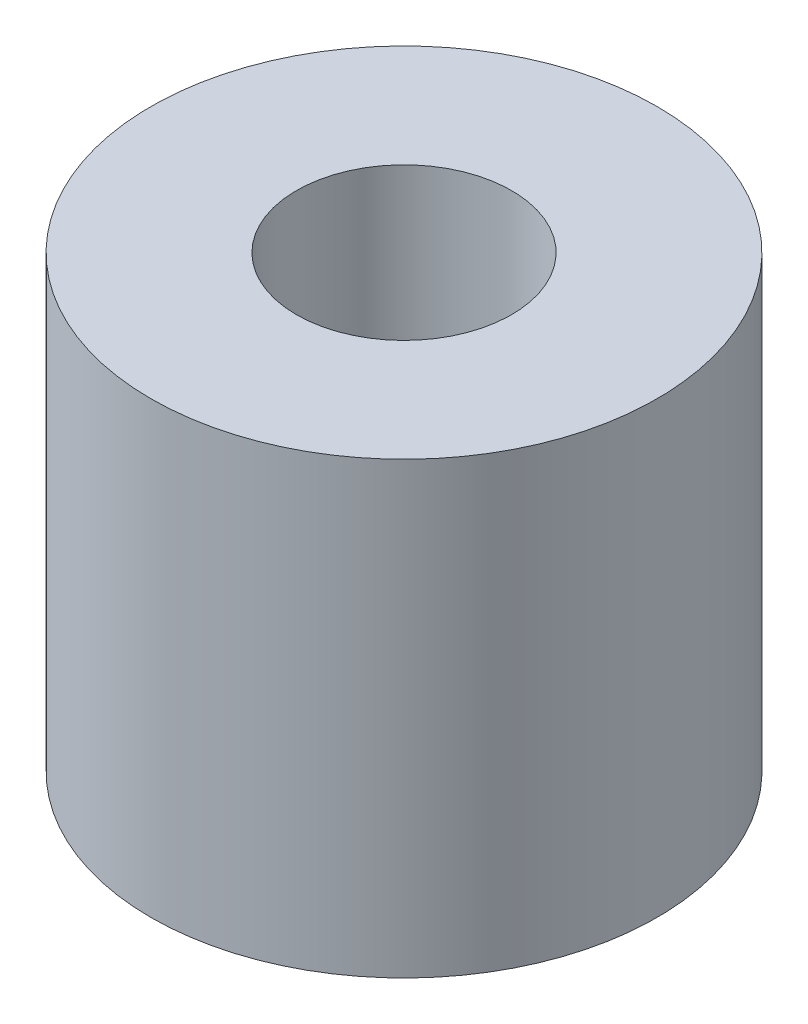
ISO-10303-21;
HEADER;
FILE_DESCRIPTION(('STEP AP214'),'2;1');
FILE_NAME('part.step','',(''),(''),'','','');
FILE_SCHEMA(('AUTOMOTIVE_DESIGN { 1 0 10303 214 1 1 1 1 }'));
ENDSEC;
DATA;
#1=APPLICATION_CONTEXT('core data for automotive mechanical design processes');
#2=APPLICATION_PROTOCOL_DEFINITION('international standard','automotive_design',2000,#1);
#3=PRODUCT_CONTEXT('',#1,'mechanical');
#4=PRODUCT('Part','Part','',(#3));
#5=PRODUCT_RELATED_PRODUCT_CATEGORY('part','',(#4));
#6=PRODUCT_DEFINITION_FORMATION('','',#4);
#7=PRODUCT_DEFINITION_CONTEXT('part definition',#1,'design');
#8=PRODUCT_DEFINITION('design','',#6,#7);
#9=PRODUCT_DEFINITION_SHAPE('','',#8);
#10=(LENGTH_UNIT() NAMED_UNIT(*) SI_UNIT(.MILLI.,.METRE.));
#11=(NAMED_UNIT(*) PLANE_ANGLE_UNIT() SI_UNIT($,.RADIAN.));
#12=(NAMED_UNIT(*) SI_UNIT($,.STERADIAN.) SOLID_ANGLE_UNIT());
#13=UNCERTAINTY_MEASURE_WITH_UNIT(LENGTH_MEASURE(1.E-05),#10,'distance_accuracy_value','');
#14=(GEOMETRIC_REPRESENTATION_CONTEXT(3) GLOBAL_UNCERTAINTY_ASSIGNED_CONTEXT((#13)) GLOBAL_UNIT_ASSIGNED_CONTEXT((#10,
#11,#12)) REPRESENTATION_CONTEXT('',''));
#15=CARTESIAN_POINT('',(0.,0.,0.));
#16=DIRECTION('',(0.,0.,1.));
#17=DIRECTION('',(1.,0.,0.));
#18=AXIS2_PLACEMENT_3D('',#15,#16,#17);
#19=CARTESIAN_POINT('',(0.,7.1,0.));
#20=DIRECTION('',(0.,1.,0.));
#21=DIRECTION('',(0.,0.,1.));
#22=AXIS2_PLACEMENT_3D('',#19,#20,#21);
#23=PLANE('',#22);
#24=CARTESIAN_POINT('',(0.,7.1,0.));
#25=DIRECTION('',(0.,1.,0.));
#26=DIRECTION('',(0.,0.,1.));
#27=AXIS2_PLACEMENT_3D('',#24,#25,#26);
#28=CIRCLE('',#27,4.);
#29=CARTESIAN_POINT('',(0.,7.1,4.));
#30=VERTEX_POINT('',#29);
#31=EDGE_CURVE('E10',#30,#30,#28,.T.);
#32=ORIENTED_EDGE('',*,*,#31,.T.);
#33=EDGE_LOOP('',(#32));
#34=FACE_BOUND('',#33,.T.);
#35=CARTESIAN_POINT('',(0.,7.1,0.));
#36=DIRECTION('',(0.,1.,0.));
#37=DIRECTION('',(0.,0.,1.));
#38=AXIS2_PLACEMENT_3D('',#35,#36,#37);
#39=CIRCLE('',#38,1.7);
#40=CARTESIAN_POINT('',(0.,7.1,1.7));
#41=VERTEX_POINT('',#40);
#42=EDGE_CURVE('E46',#41,#41,#39,.T.);
#43=ORIENTED_EDGE('',*,*,#42,.F.);
#44=EDGE_LOOP('',(#43));
#45=FACE_BOUND('',#44,.T.);
#46=ADVANCED_FACE('F35',(#34,#45),#23,.T.);
#47=CARTESIAN_POINT('',(0.,0.,0.));
#48=DIRECTION('',(0.,1.,0.));
#49=DIRECTION('',(0.,0.,1.));
#50=AXIS2_PLACEMENT_3D('',#47,#48,#49);
#51=PLANE('',#50);
#52=CARTESIAN_POINT('',(0.,0.,0.));
#53=DIRECTION('',(0.,1.,0.));
#54=DIRECTION('',(0.,0.,1.));
#55=AXIS2_PLACEMENT_3D('',#52,#53,#54);
#56=CIRCLE('',#55,4.);
#57=CARTESIAN_POINT('',(0.,0.,4.));
#58=VERTEX_POINT('',#57);
#59=EDGE_CURVE('E39',#58,#58,#56,.T.);
#60=ORIENTED_EDGE('',*,*,#59,.F.);
#61=EDGE_LOOP('',(#60));
#62=FACE_BOUND('',#61,.T.);
#63=CARTESIAN_POINT('',(0.,0.,0.));
#64=DIRECTION('',(0.,1.,0.));
#65=DIRECTION('',(0.,0.,1.));
#66=AXIS2_PLACEMENT_3D('',#63,#64,#65);
#67=CIRCLE('',#66,1.7);
#68=CARTESIAN_POINT('',(0.,0.,1.7));
#69=VERTEX_POINT('',#68);
#70=EDGE_CURVE('E48',#69,#69,#67,.T.);
#71=ORIENTED_EDGE('',*,*,#70,.T.);
#72=EDGE_LOOP('',(#71));
#73=FACE_BOUND('',#72,.T.);
#74=ADVANCED_FACE('F58',(#62,#73),#51,.F.);
#75=CARTESIAN_POINT('',(0.,7.1,0.));
#76=DIRECTION('',(0.,-1.,0.));
#77=DIRECTION('',(0.,0.,-1.));
#78=AXIS2_PLACEMENT_3D('',#75,#76,#77);
#79=CYLINDRICAL_SURFACE('',#78,4.);
#80=ORIENTED_EDGE('',*,*,#31,.F.);
#81=EDGE_LOOP('',(#80));
#82=FACE_BOUND('',#81,.T.);
#83=ORIENTED_EDGE('',*,*,#59,.T.);
#84=EDGE_LOOP('',(#83));
#85=FACE_BOUND('',#84,.T.);
#86=ADVANCED_FACE('F37',(#82,#85),#79,.T.);
#87=CARTESIAN_POINT('',(0.,7.1,0.));
#88=DIRECTION('',(0.,-1.,0.));
#89=DIRECTION('',(0.,0.,-1.));
#90=AXIS2_PLACEMENT_3D('',#87,#88,#89);
#91=CYLINDRICAL_SURFACE('',#90,1.7);
#92=ORIENTED_EDGE('',*,*,#42,.T.);
#93=EDGE_LOOP('',(#92));
#94=FACE_BOUND('',#93,.T.);
#95=ORIENTED_EDGE('',*,*,#70,.F.);
#96=EDGE_LOOP('',(#95));
#97=FACE_BOUND('',#96,.T.);
#98=ADVANCED_FACE('F54',(#94,#97),#91,.F.);
#99=CLOSED_SHELL('',(#46,#74,#86,#98));
#100=MANIFOLD_SOLID_BREP('B2',#99);
#101=ADVANCED_BREP_SHAPE_REPRESENTATION('',(#18,#100),#14);
#102=SHAPE_DEFINITION_REPRESENTATION(#9,#101);
ENDSEC;
END-ISO-10303-21;
